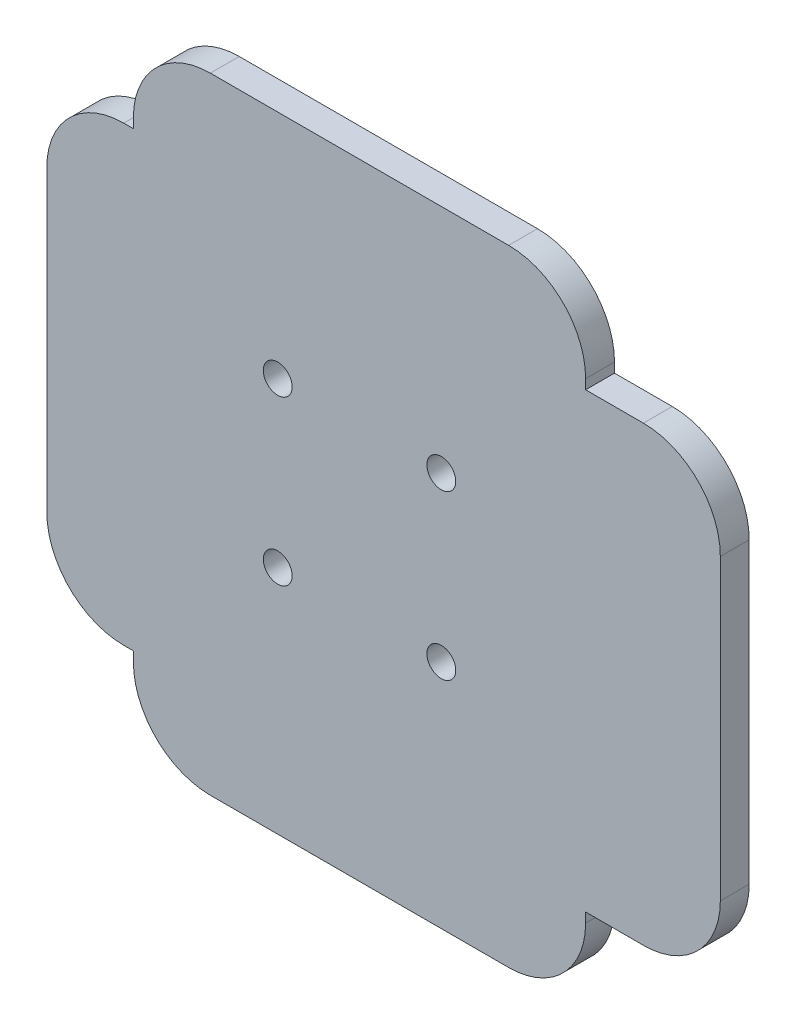
ISO-10303-21;
HEADER;
FILE_DESCRIPTION(('STEP AP214'),'2;1');
FILE_NAME('part.step','',(''),(''),'','','');
FILE_SCHEMA(('AUTOMOTIVE_DESIGN { 1 0 10303 214 1 1 1 1 }'));
ENDSEC;
DATA;
#1=APPLICATION_CONTEXT('core data for automotive mechanical design processes');
#2=APPLICATION_PROTOCOL_DEFINITION('international standard','automotive_design',2000,#1);
#3=PRODUCT_CONTEXT('',#1,'mechanical');
#4=PRODUCT('Part','Part','',(#3));
#5=PRODUCT_RELATED_PRODUCT_CATEGORY('part','',(#4));
#6=PRODUCT_DEFINITION_FORMATION('','',#4);
#7=PRODUCT_DEFINITION_CONTEXT('part definition',#1,'design');
#8=PRODUCT_DEFINITION('design','',#6,#7);
#9=PRODUCT_DEFINITION_SHAPE('','',#8);
#10=(LENGTH_UNIT() NAMED_UNIT(*) SI_UNIT(.MILLI.,.METRE.));
#11=(NAMED_UNIT(*) PLANE_ANGLE_UNIT() SI_UNIT($,.RADIAN.));
#12=(NAMED_UNIT(*) SI_UNIT($,.STERADIAN.) SOLID_ANGLE_UNIT());
#13=UNCERTAINTY_MEASURE_WITH_UNIT(LENGTH_MEASURE(1.E-05),#10,'distance_accuracy_value','');
#14=(GEOMETRIC_REPRESENTATION_CONTEXT(3) GLOBAL_UNCERTAINTY_ASSIGNED_CONTEXT((#13)) GLOBAL_UNIT_ASSIGNED_CONTEXT((#10,
#11,#12)) REPRESENTATION_CONTEXT('',''));
#15=CARTESIAN_POINT('',(0.,0.,0.));
#16=DIRECTION('',(0.,0.,1.));
#17=DIRECTION('',(1.,0.,0.));
#18=AXIS2_PLACEMENT_3D('',#15,#16,#17);
#19=CARTESIAN_POINT('',(7.50000000000001,-1.5,3.));
#20=DIRECTION('',(0.,0.,-1.));
#21=DIRECTION('',(-1.,0.,0.));
#22=AXIS2_PLACEMENT_3D('',#19,#20,#21);
#23=CYLINDRICAL_SURFACE('',#22,8.);
#24=CARTESIAN_POINT('',(7.50000000000001,-1.5,0.));
#25=DIRECTION('',(0.,0.,1.));
#26=DIRECTION('',(1.,0.,0.));
#27=AXIS2_PLACEMENT_3D('',#24,#25,#26);
#28=CIRCLE('',#27,8.);
#29=CARTESIAN_POINT('',(-0.5,-1.5,0.));
#30=VERTEX_POINT('',#29);
#31=CARTESIAN_POINT('',(7.50000000000001,-9.50000000000001,0.));
#32=VERTEX_POINT('',#31);
#33=EDGE_CURVE('E202',#30,#32,#28,.T.);
#34=ORIENTED_EDGE('',*,*,#33,.T.);
#35=DIRECTION('',(0.,0.,-1.));
#36=VECTOR('',#35,1.);
#37=CARTESIAN_POINT('',(7.50000000000001,-9.50000000000001,3.));
#38=LINE('',#37,#36);
#39=CARTESIAN_POINT('',(7.50000000000001,-9.50000000000001,3.));
#40=VERTEX_POINT('',#39);
#41=EDGE_CURVE('E11',#40,#32,#38,.T.);
#42=ORIENTED_EDGE('',*,*,#41,.F.);
#43=CARTESIAN_POINT('',(7.50000000000001,-1.5,3.));
#44=DIRECTION('',(0.,0.,1.));
#45=DIRECTION('',(1.,0.,0.));
#46=AXIS2_PLACEMENT_3D('',#43,#44,#45);
#47=CIRCLE('',#46,8.);
#48=CARTESIAN_POINT('',(-0.5,-1.5,3.));
#49=VERTEX_POINT('',#48);
#50=EDGE_CURVE('E241',#49,#40,#47,.T.);
#51=ORIENTED_EDGE('',*,*,#50,.F.);
#52=DIRECTION('',(0.,0.,-1.));
#53=VECTOR('',#52,1.);
#54=CARTESIAN_POINT('',(-0.5,-1.5,3.));
#55=LINE('',#54,#53);
#56=EDGE_CURVE('E198',#49,#30,#55,.T.);
#57=ORIENTED_EDGE('',*,*,#56,.T.);
#58=EDGE_LOOP('',(#34,#42,#51,#57));
#59=FACE_BOUND('',#58,.T.);
#60=ADVANCED_FACE('F34',(#59),#23,.T.);
#61=CARTESIAN_POINT('',(7.50000000000001,-9.50000000000001,3.));
#62=DIRECTION('',(0.,1.,0.));
#63=DIRECTION('',(0.,0.,1.));
#64=AXIS2_PLACEMENT_3D('',#61,#62,#63);
#65=PLANE('',#64);
#66=DIRECTION('',(1.,0.,0.));
#67=VECTOR('',#66,1.);
#68=CARTESIAN_POINT('',(7.50000000000001,-9.50000000000001,0.));
#69=LINE('',#68,#67);
#70=CARTESIAN_POINT('',(38.5,-9.50000000000001,0.));
#71=VERTEX_POINT('',#70);
#72=EDGE_CURVE('E205',#32,#71,#69,.T.);
#73=ORIENTED_EDGE('',*,*,#72,.T.);
#74=DIRECTION('',(0.,0.,-1.));
#75=VECTOR('',#74,1.);
#76=CARTESIAN_POINT('',(38.5,-9.50000000000001,3.));
#77=LINE('',#76,#75);
#78=CARTESIAN_POINT('',(38.5,-9.50000000000001,3.));
#79=VERTEX_POINT('',#78);
#80=EDGE_CURVE('E42',#79,#71,#77,.T.);
#81=ORIENTED_EDGE('',*,*,#80,.F.);
#82=DIRECTION('',(1.,0.,0.));
#83=VECTOR('',#82,1.);
#84=CARTESIAN_POINT('',(7.50000000000001,-9.50000000000001,3.));
#85=LINE('',#84,#83);
#86=EDGE_CURVE('E129',#40,#79,#85,.T.);
#87=ORIENTED_EDGE('',*,*,#86,.F.);
#88=ORIENTED_EDGE('',*,*,#41,.T.);
#89=EDGE_LOOP('',(#73,#81,#87,#88));
#90=FACE_BOUND('',#89,.T.);
#91=ADVANCED_FACE('F360',(#90),#65,.F.);
#92=CARTESIAN_POINT('',(38.5,-1.5,3.));
#93=DIRECTION('',(0.,0.,-1.));
#94=DIRECTION('',(-1.,0.,0.));
#95=AXIS2_PLACEMENT_3D('',#92,#93,#94);
#96=CYLINDRICAL_SURFACE('',#95,8.);
#97=CARTESIAN_POINT('',(38.5,-1.5,0.));
#98=DIRECTION('',(0.,0.,1.));
#99=DIRECTION('',(1.,0.,0.));
#100=AXIS2_PLACEMENT_3D('',#97,#98,#99);
#101=CIRCLE('',#100,8.);
#102=CARTESIAN_POINT('',(46.5,-1.5,0.));
#103=VERTEX_POINT('',#102);
#104=EDGE_CURVE('E208',#71,#103,#101,.T.);
#105=ORIENTED_EDGE('',*,*,#104,.T.);
#106=DIRECTION('',(0.,0.,-1.));
#107=VECTOR('',#106,1.);
#108=CARTESIAN_POINT('',(46.5,-1.5,3.));
#109=LINE('',#108,#107);
#110=CARTESIAN_POINT('',(46.5,-1.5,3.));
#111=VERTEX_POINT('',#110);
#112=EDGE_CURVE('E284',#111,#103,#109,.T.);
#113=ORIENTED_EDGE('',*,*,#112,.F.);
#114=CARTESIAN_POINT('',(38.5,-1.5,3.));
#115=DIRECTION('',(0.,0.,1.));
#116=DIRECTION('',(1.,0.,0.));
#117=AXIS2_PLACEMENT_3D('',#114,#115,#116);
#118=CIRCLE('',#117,8.);
#119=EDGE_CURVE('E292',#79,#111,#118,.T.);
#120=ORIENTED_EDGE('',*,*,#119,.F.);
#121=ORIENTED_EDGE('',*,*,#80,.T.);
#122=EDGE_LOOP('',(#105,#113,#120,#121));
#123=FACE_BOUND('',#122,.T.);
#124=ADVANCED_FACE('F290',(#123),#96,.T.);
#125=CARTESIAN_POINT('',(46.5,-1.5,3.));
#126=DIRECTION('',(-1.,0.,0.));
#127=DIRECTION('',(0.,0.,1.));
#128=AXIS2_PLACEMENT_3D('',#125,#126,#127);
#129=PLANE('',#128);
#130=DIRECTION('',(0.,1.,0.));
#131=VECTOR('',#130,1.);
#132=CARTESIAN_POINT('',(46.5,-1.5,0.));
#133=LINE('',#132,#131);
#134=CARTESIAN_POINT('',(46.5,-0.499999999999997,0.));
#135=VERTEX_POINT('',#134);
#136=EDGE_CURVE('E210',#103,#135,#133,.T.);
#137=ORIENTED_EDGE('',*,*,#136,.T.);
#138=DIRECTION('',(0.,0.,-1.));
#139=VECTOR('',#138,1.);
#140=CARTESIAN_POINT('',(46.5,-0.499999999999997,3.));
#141=LINE('',#140,#139);
#142=CARTESIAN_POINT('',(46.5,-0.499999999999997,3.));
#143=VERTEX_POINT('',#142);
#144=EDGE_CURVE('E281',#143,#135,#141,.T.);
#145=ORIENTED_EDGE('',*,*,#144,.F.);
#146=DIRECTION('',(0.,1.,0.));
#147=VECTOR('',#146,1.);
#148=CARTESIAN_POINT('',(46.5,-1.5,3.));
#149=LINE('',#148,#147);
#150=EDGE_CURVE('E310',#111,#143,#149,.T.);
#151=ORIENTED_EDGE('',*,*,#150,.F.);
#152=ORIENTED_EDGE('',*,*,#112,.T.);
#153=EDGE_LOOP('',(#137,#145,#151,#152));
#154=FACE_BOUND('',#153,.T.);
#155=ADVANCED_FACE('F301',(#154),#129,.F.);
#156=CARTESIAN_POINT('',(46.5,-0.499999999999997,3.));
#157=DIRECTION('',(0.,1.,0.));
#158=DIRECTION('',(-1.,0.,0.));
#159=AXIS2_PLACEMENT_3D('',#156,#157,#158);
#160=PLANE('',#159);
#161=DIRECTION('',(1.,0.,0.));
#162=VECTOR('',#161,1.);
#163=CARTESIAN_POINT('',(46.5,-0.499999999999997,0.));
#164=LINE('',#163,#162);
#165=CARTESIAN_POINT('',(52.5,-0.500000000000025,0.));
#166=VERTEX_POINT('',#165);
#167=EDGE_CURVE('E212',#135,#166,#164,.T.);
#168=ORIENTED_EDGE('',*,*,#167,.T.);
#169=DIRECTION('',(0.,0.,-1.));
#170=VECTOR('',#169,1.);
#171=CARTESIAN_POINT('',(52.5,-0.500000000000025,3.));
#172=LINE('',#171,#170);
#173=CARTESIAN_POINT('',(52.5,-0.500000000000025,3.));
#174=VERTEX_POINT('',#173);
#175=EDGE_CURVE('E278',#174,#166,#172,.T.);
#176=ORIENTED_EDGE('',*,*,#175,.F.);
#177=DIRECTION('',(1.,0.,0.));
#178=VECTOR('',#177,1.);
#179=CARTESIAN_POINT('',(46.5,-0.499999999999997,3.));
#180=LINE('',#179,#178);
#181=EDGE_CURVE('E307',#143,#174,#180,.T.);
#182=ORIENTED_EDGE('',*,*,#181,.F.);
#183=ORIENTED_EDGE('',*,*,#144,.T.);
#184=EDGE_LOOP('',(#168,#176,#182,#183));
#185=FACE_BOUND('',#184,.T.);
#186=ADVANCED_FACE('F305',(#185),#160,.F.);
#187=CARTESIAN_POINT('',(52.5,7.49999999999995,3.));
#188=DIRECTION('',(0.,0.,-1.));
#189=DIRECTION('',(-1.,0.,0.));
#190=AXIS2_PLACEMENT_3D('',#187,#188,#189);
#191=CYLINDRICAL_SURFACE('',#190,7.99999999999998);
#192=CARTESIAN_POINT('',(52.5,7.49999999999995,0.));
#193=DIRECTION('',(0.,0.,1.));
#194=DIRECTION('',(1.,0.,0.));
#195=AXIS2_PLACEMENT_3D('',#192,#193,#194);
#196=CIRCLE('',#195,7.99999999999998);
#197=CARTESIAN_POINT('',(60.5,7.49999999999995,0.));
#198=VERTEX_POINT('',#197);
#199=EDGE_CURVE('E214',#166,#198,#196,.T.);
#200=ORIENTED_EDGE('',*,*,#199,.T.);
#201=DIRECTION('',(0.,0.,-1.));
#202=VECTOR('',#201,1.);
#203=CARTESIAN_POINT('',(60.5,7.49999999999995,3.));
#204=LINE('',#203,#202);
#205=CARTESIAN_POINT('',(60.5,7.49999999999995,3.));
#206=VERTEX_POINT('',#205);
#207=EDGE_CURVE('E275',#206,#198,#204,.T.);
#208=ORIENTED_EDGE('',*,*,#207,.F.);
#209=CARTESIAN_POINT('',(52.5,7.49999999999995,3.));
#210=DIRECTION('',(0.,0.,1.));
#211=DIRECTION('',(1.,0.,0.));
#212=AXIS2_PLACEMENT_3D('',#209,#210,#211);
#213=CIRCLE('',#212,7.99999999999998);
#214=EDGE_CURVE('E309',#174,#206,#213,.T.);
#215=ORIENTED_EDGE('',*,*,#214,.F.);
#216=ORIENTED_EDGE('',*,*,#175,.T.);
#217=EDGE_LOOP('',(#200,#208,#215,#216));
#218=FACE_BOUND('',#217,.T.);
#219=ADVANCED_FACE('F373',(#218),#191,.T.);
#220=CARTESIAN_POINT('',(60.5,7.49999999999995,3.));
#221=DIRECTION('',(-1.,0.,0.));
#222=DIRECTION('',(0.,-1.,0.));
#223=AXIS2_PLACEMENT_3D('',#220,#221,#222);
#224=PLANE('',#223);
#225=DIRECTION('',(0.,1.,0.));
#226=VECTOR('',#225,1.);
#227=CARTESIAN_POINT('',(60.5,7.49999999999995,0.));
#228=LINE('',#227,#226);
#229=CARTESIAN_POINT('',(60.5,38.5000000000001,0.));
#230=VERTEX_POINT('',#229);
#231=EDGE_CURVE('E216',#198,#230,#228,.T.);
#232=ORIENTED_EDGE('',*,*,#231,.T.);
#233=DIRECTION('',(0.,0.,-1.));
#234=VECTOR('',#233,1.);
#235=CARTESIAN_POINT('',(60.5,38.5000000000001,3.));
#236=LINE('',#235,#234);
#237=CARTESIAN_POINT('',(60.5,38.5000000000001,3.));
#238=VERTEX_POINT('',#237);
#239=EDGE_CURVE('E272',#238,#230,#236,.T.);
#240=ORIENTED_EDGE('',*,*,#239,.F.);
#241=DIRECTION('',(0.,1.,0.));
#242=VECTOR('',#241,1.);
#243=CARTESIAN_POINT('',(60.5,7.49999999999995,3.));
#244=LINE('',#243,#242);
#245=EDGE_CURVE('E312',#206,#238,#244,.T.);
#246=ORIENTED_EDGE('',*,*,#245,.F.);
#247=ORIENTED_EDGE('',*,*,#207,.T.);
#248=EDGE_LOOP('',(#232,#240,#246,#247));
#249=FACE_BOUND('',#248,.T.);
#250=ADVANCED_FACE('F376',(#249),#224,.F.);
#251=CARTESIAN_POINT('',(52.5,38.5000000000001,3.));
#252=DIRECTION('',(0.,0.,-1.));
#253=DIRECTION('',(-1.,0.,0.));
#254=AXIS2_PLACEMENT_3D('',#251,#252,#253);
#255=CYLINDRICAL_SURFACE('',#254,8.00000000000001);
#256=CARTESIAN_POINT('',(52.5,38.5000000000001,0.));
#257=DIRECTION('',(0.,0.,1.));
#258=DIRECTION('',(1.,0.,0.));
#259=AXIS2_PLACEMENT_3D('',#256,#257,#258);
#260=CIRCLE('',#259,8.00000000000001);
#261=CARTESIAN_POINT('',(52.5,46.5000000000001,0.));
#262=VERTEX_POINT('',#261);
#263=EDGE_CURVE('E218',#230,#262,#260,.T.);
#264=ORIENTED_EDGE('',*,*,#263,.T.);
#265=DIRECTION('',(0.,0.,-1.));
#266=VECTOR('',#265,1.);
#267=CARTESIAN_POINT('',(52.5,46.5000000000001,3.));
#268=LINE('',#267,#266);
#269=CARTESIAN_POINT('',(52.5,46.5000000000001,3.));
#270=VERTEX_POINT('',#269);
#271=EDGE_CURVE('E269',#270,#262,#268,.T.);
#272=ORIENTED_EDGE('',*,*,#271,.F.);
#273=CARTESIAN_POINT('',(52.5,38.5000000000001,3.));
#274=DIRECTION('',(0.,0.,1.));
#275=DIRECTION('',(1.,0.,0.));
#276=AXIS2_PLACEMENT_3D('',#273,#274,#275);
#277=CIRCLE('',#276,8.00000000000001);
#278=EDGE_CURVE('E318',#238,#270,#277,.T.);
#279=ORIENTED_EDGE('',*,*,#278,.F.);
#280=ORIENTED_EDGE('',*,*,#239,.T.);
#281=EDGE_LOOP('',(#264,#272,#279,#280));
#282=FACE_BOUND('',#281,.T.);
#283=ADVANCED_FACE('F380',(#282),#255,.T.);
#284=CARTESIAN_POINT('',(52.5,46.5000000000001,3.));
#285=DIRECTION('',(0.,-1.,0.));
#286=DIRECTION('',(1.,0.,0.));
#287=AXIS2_PLACEMENT_3D('',#284,#285,#286);
#288=PLANE('',#287);
#289=DIRECTION('',(-1.,0.,0.));
#290=VECTOR('',#289,1.);
#291=CARTESIAN_POINT('',(52.5,46.5000000000001,0.));
#292=LINE('',#291,#290);
#293=CARTESIAN_POINT('',(46.5,46.5000000000001,0.));
#294=VERTEX_POINT('',#293);
#295=EDGE_CURVE('E220',#262,#294,#292,.T.);
#296=ORIENTED_EDGE('',*,*,#295,.T.);
#297=DIRECTION('',(0.,0.,-1.));
#298=VECTOR('',#297,1.);
#299=CARTESIAN_POINT('',(46.5,46.5000000000001,3.));
#300=LINE('',#299,#298);
#301=CARTESIAN_POINT('',(46.5,46.5000000000001,3.));
#302=VERTEX_POINT('',#301);
#303=EDGE_CURVE('E266',#302,#294,#300,.T.);
#304=ORIENTED_EDGE('',*,*,#303,.F.);
#305=DIRECTION('',(-1.,0.,0.));
#306=VECTOR('',#305,1.);
#307=CARTESIAN_POINT('',(52.5,46.5000000000001,3.));
#308=LINE('',#307,#306);
#309=EDGE_CURVE('E320',#270,#302,#308,.T.);
#310=ORIENTED_EDGE('',*,*,#309,.F.);
#311=ORIENTED_EDGE('',*,*,#271,.T.);
#312=EDGE_LOOP('',(#296,#304,#310,#311));
#313=FACE_BOUND('',#312,.T.);
#314=ADVANCED_FACE('F384',(#313),#288,.F.);
#315=CARTESIAN_POINT('',(46.5,46.5000000000001,3.));
#316=DIRECTION('',(-1.,0.,0.));
#317=DIRECTION('',(0.,0.,1.));
#318=AXIS2_PLACEMENT_3D('',#315,#316,#317);
#319=PLANE('',#318);
#320=DIRECTION('',(0.,1.,0.));
#321=VECTOR('',#320,1.);
#322=CARTESIAN_POINT('',(46.5,46.5000000000001,0.));
#323=LINE('',#322,#321);
#324=CARTESIAN_POINT('',(46.5,47.5,0.));
#325=VERTEX_POINT('',#324);
#326=EDGE_CURVE('E222',#294,#325,#323,.T.);
#327=ORIENTED_EDGE('',*,*,#326,.T.);
#328=DIRECTION('',(0.,0.,-1.));
#329=VECTOR('',#328,1.);
#330=CARTESIAN_POINT('',(46.5,47.5,3.));
#331=LINE('',#330,#329);
#332=CARTESIAN_POINT('',(46.5,47.5,3.));
#333=VERTEX_POINT('',#332);
#334=EDGE_CURVE('E263',#333,#325,#331,.T.);
#335=ORIENTED_EDGE('',*,*,#334,.F.);
#336=DIRECTION('',(0.,1.,0.));
#337=VECTOR('',#336,1.);
#338=CARTESIAN_POINT('',(46.5,46.5000000000001,3.));
#339=LINE('',#338,#337);
#340=EDGE_CURVE('E322',#302,#333,#339,.T.);
#341=ORIENTED_EDGE('',*,*,#340,.F.);
#342=ORIENTED_EDGE('',*,*,#303,.T.);
#343=EDGE_LOOP('',(#327,#335,#341,#342));
#344=FACE_BOUND('',#343,.T.);
#345=ADVANCED_FACE('F388',(#344),#319,.F.);
#346=CARTESIAN_POINT('',(38.5,47.5,3.));
#347=DIRECTION('',(0.,0.,-1.));
#348=DIRECTION('',(-1.,0.,0.));
#349=AXIS2_PLACEMENT_3D('',#346,#347,#348);
#350=CYLINDRICAL_SURFACE('',#349,8.);
#351=CARTESIAN_POINT('',(38.5,47.5,0.));
#352=DIRECTION('',(0.,0.,1.));
#353=DIRECTION('',(1.,0.,0.));
#354=AXIS2_PLACEMENT_3D('',#351,#352,#353);
#355=CIRCLE('',#354,8.);
#356=CARTESIAN_POINT('',(38.5,55.5,0.));
#357=VERTEX_POINT('',#356);
#358=EDGE_CURVE('E224',#325,#357,#355,.T.);
#359=ORIENTED_EDGE('',*,*,#358,.T.);
#360=DIRECTION('',(0.,0.,-1.));
#361=VECTOR('',#360,1.);
#362=CARTESIAN_POINT('',(38.5,55.5,3.));
#363=LINE('',#362,#361);
#364=CARTESIAN_POINT('',(38.5,55.5,3.));
#365=VERTEX_POINT('',#364);
#366=EDGE_CURVE('E260',#365,#357,#363,.T.);
#367=ORIENTED_EDGE('',*,*,#366,.F.);
#368=CARTESIAN_POINT('',(38.5,47.5,3.));
#369=DIRECTION('',(0.,0.,1.));
#370=DIRECTION('',(1.,0.,0.));
#371=AXIS2_PLACEMENT_3D('',#368,#369,#370);
#372=CIRCLE('',#371,8.);
#373=EDGE_CURVE('E324',#333,#365,#372,.T.);
#374=ORIENTED_EDGE('',*,*,#373,.F.);
#375=ORIENTED_EDGE('',*,*,#334,.T.);
#376=EDGE_LOOP('',(#359,#367,#374,#375));
#377=FACE_BOUND('',#376,.T.);
#378=ADVANCED_FACE('F392',(#377),#350,.T.);
#379=CARTESIAN_POINT('',(38.5,55.5,3.));
#380=DIRECTION('',(0.,-1.,0.));
#381=DIRECTION('',(0.,0.,-1.));
#382=AXIS2_PLACEMENT_3D('',#379,#380,#381);
#383=PLANE('',#382);
#384=DIRECTION('',(-1.,0.,0.));
#385=VECTOR('',#384,1.);
#386=CARTESIAN_POINT('',(38.5,55.5,0.));
#387=LINE('',#386,#385);
#388=CARTESIAN_POINT('',(7.50000000000001,55.5,0.));
#389=VERTEX_POINT('',#388);
#390=EDGE_CURVE('E226',#357,#389,#387,.T.);
#391=ORIENTED_EDGE('',*,*,#390,.T.);
#392=DIRECTION('',(0.,0.,-1.));
#393=VECTOR('',#392,1.);
#394=CARTESIAN_POINT('',(7.50000000000001,55.5,3.));
#395=LINE('',#394,#393);
#396=CARTESIAN_POINT('',(7.50000000000001,55.5,3.));
#397=VERTEX_POINT('',#396);
#398=EDGE_CURVE('E257',#397,#389,#395,.T.);
#399=ORIENTED_EDGE('',*,*,#398,.F.);
#400=DIRECTION('',(-1.,0.,0.));
#401=VECTOR('',#400,1.);
#402=CARTESIAN_POINT('',(38.5,55.5,3.));
#403=LINE('',#402,#401);
#404=EDGE_CURVE('E326',#365,#397,#403,.T.);
#405=ORIENTED_EDGE('',*,*,#404,.F.);
#406=ORIENTED_EDGE('',*,*,#366,.T.);
#407=EDGE_LOOP('',(#391,#399,#405,#406));
#408=FACE_BOUND('',#407,.T.);
#409=ADVANCED_FACE('F396',(#408),#383,.F.);
#410=CARTESIAN_POINT('',(7.50000000000001,47.5,3.));
#411=DIRECTION('',(0.,0.,-1.));
#412=DIRECTION('',(-1.,0.,0.));
#413=AXIS2_PLACEMENT_3D('',#410,#411,#412);
#414=CYLINDRICAL_SURFACE('',#413,8.);
#415=CARTESIAN_POINT('',(7.50000000000001,47.5,0.));
#416=DIRECTION('',(0.,0.,1.));
#417=DIRECTION('',(1.,0.,0.));
#418=AXIS2_PLACEMENT_3D('',#415,#416,#417);
#419=CIRCLE('',#418,8.);
#420=CARTESIAN_POINT('',(-0.5,47.5,0.));
#421=VERTEX_POINT('',#420);
#422=EDGE_CURVE('E228',#389,#421,#419,.T.);
#423=ORIENTED_EDGE('',*,*,#422,.T.);
#424=DIRECTION('',(0.,0.,-1.));
#425=VECTOR('',#424,1.);
#426=CARTESIAN_POINT('',(-0.5,47.5,3.));
#427=LINE('',#426,#425);
#428=CARTESIAN_POINT('',(-0.5,47.5,3.));
#429=VERTEX_POINT('',#428);
#430=EDGE_CURVE('E254',#429,#421,#427,.T.);
#431=ORIENTED_EDGE('',*,*,#430,.F.);
#432=CARTESIAN_POINT('',(7.50000000000001,47.5,3.));
#433=DIRECTION('',(0.,0.,1.));
#434=DIRECTION('',(1.,0.,0.));
#435=AXIS2_PLACEMENT_3D('',#432,#433,#434);
#436=CIRCLE('',#435,8.);
#437=EDGE_CURVE('E328',#397,#429,#436,.T.);
#438=ORIENTED_EDGE('',*,*,#437,.F.);
#439=ORIENTED_EDGE('',*,*,#398,.T.);
#440=EDGE_LOOP('',(#423,#431,#438,#439));
#441=FACE_BOUND('',#440,.T.);
#442=ADVANCED_FACE('F400',(#441),#414,.T.);
#443=CARTESIAN_POINT('',(-0.5,47.5,3.));
#444=DIRECTION('',(1.,0.,0.));
#445=DIRECTION('',(0.,0.,-1.));
#446=AXIS2_PLACEMENT_3D('',#443,#444,#445);
#447=PLANE('',#446);
#448=DIRECTION('',(0.,-1.,0.));
#449=VECTOR('',#448,1.);
#450=CARTESIAN_POINT('',(-0.5,47.5,0.));
#451=LINE('',#450,#449);
#452=CARTESIAN_POINT('',(-0.5,46.5,0.));
#453=VERTEX_POINT('',#452);
#454=EDGE_CURVE('E230',#421,#453,#451,.T.);
#455=ORIENTED_EDGE('',*,*,#454,.T.);
#456=DIRECTION('',(0.,0.,-1.));
#457=VECTOR('',#456,1.);
#458=CARTESIAN_POINT('',(-0.5,46.5,3.));
#459=LINE('',#458,#457);
#460=CARTESIAN_POINT('',(-0.5,46.5,3.));
#461=VERTEX_POINT('',#460);
#462=EDGE_CURVE('E251',#461,#453,#459,.T.);
#463=ORIENTED_EDGE('',*,*,#462,.F.);
#464=DIRECTION('',(0.,-1.,0.));
#465=VECTOR('',#464,1.);
#466=CARTESIAN_POINT('',(-0.5,47.5,3.));
#467=LINE('',#466,#465);
#468=EDGE_CURVE('E330',#429,#461,#467,.T.);
#469=ORIENTED_EDGE('',*,*,#468,.F.);
#470=ORIENTED_EDGE('',*,*,#430,.T.);
#471=EDGE_LOOP('',(#455,#463,#469,#470));
#472=FACE_BOUND('',#471,.T.);
#473=ADVANCED_FACE('F404',(#472),#447,.F.);
#474=CARTESIAN_POINT('',(-0.5,46.5,3.));
#475=DIRECTION('',(0.,-1.,0.));
#476=DIRECTION('',(0.,0.,-1.));
#477=AXIS2_PLACEMENT_3D('',#474,#475,#476);
#478=PLANE('',#477);
#479=DIRECTION('',(-1.,0.,0.));
#480=VECTOR('',#479,1.);
#481=CARTESIAN_POINT('',(-0.5,46.5,0.));
#482=LINE('',#481,#480);
#483=CARTESIAN_POINT('',(-1.49999999999999,46.5,0.));
#484=VERTEX_POINT('',#483);
#485=EDGE_CURVE('E232',#453,#484,#482,.T.);
#486=ORIENTED_EDGE('',*,*,#485,.T.);
#487=DIRECTION('',(0.,0.,-1.));
#488=VECTOR('',#487,1.);
#489=CARTESIAN_POINT('',(-1.49999999999999,46.5,3.));
#490=LINE('',#489,#488);
#491=CARTESIAN_POINT('',(-1.49999999999999,46.5,3.));
#492=VERTEX_POINT('',#491);
#493=EDGE_CURVE('E248',#492,#484,#490,.T.);
#494=ORIENTED_EDGE('',*,*,#493,.F.);
#495=DIRECTION('',(-1.,0.,0.));
#496=VECTOR('',#495,1.);
#497=CARTESIAN_POINT('',(-0.5,46.5,3.));
#498=LINE('',#497,#496);
#499=EDGE_CURVE('E332',#461,#492,#498,.T.);
#500=ORIENTED_EDGE('',*,*,#499,.F.);
#501=ORIENTED_EDGE('',*,*,#462,.T.);
#502=EDGE_LOOP('',(#486,#494,#500,#501));
#503=FACE_BOUND('',#502,.T.);
#504=ADVANCED_FACE('F408',(#503),#478,.F.);
#505=CARTESIAN_POINT('',(-1.49999999999999,38.5,3.));
#506=DIRECTION('',(0.,0.,-1.));
#507=DIRECTION('',(-1.,0.,0.));
#508=AXIS2_PLACEMENT_3D('',#505,#506,#507);
#509=CYLINDRICAL_SURFACE('',#508,8.);
#510=CARTESIAN_POINT('',(-1.49999999999999,38.5,0.));
#511=DIRECTION('',(0.,0.,1.));
#512=DIRECTION('',(1.,0.,0.));
#513=AXIS2_PLACEMENT_3D('',#510,#511,#512);
#514=CIRCLE('',#513,8.);
#515=CARTESIAN_POINT('',(-9.49999999999998,38.4999999999999,0.));
#516=VERTEX_POINT('',#515);
#517=EDGE_CURVE('E234',#484,#516,#514,.T.);
#518=ORIENTED_EDGE('',*,*,#517,.T.);
#519=DIRECTION('',(0.,0.,-1.));
#520=VECTOR('',#519,1.);
#521=CARTESIAN_POINT('',(-9.49999999999998,38.4999999999999,3.));
#522=LINE('',#521,#520);
#523=CARTESIAN_POINT('',(-9.49999999999998,38.4999999999999,3.));
#524=VERTEX_POINT('',#523);
#525=EDGE_CURVE('E245',#524,#516,#522,.T.);
#526=ORIENTED_EDGE('',*,*,#525,.F.);
#527=CARTESIAN_POINT('',(-1.49999999999999,38.5,3.));
#528=DIRECTION('',(0.,0.,1.));
#529=DIRECTION('',(1.,0.,0.));
#530=AXIS2_PLACEMENT_3D('',#527,#528,#529);
#531=CIRCLE('',#530,8.);
#532=EDGE_CURVE('E334',#492,#524,#531,.T.);
#533=ORIENTED_EDGE('',*,*,#532,.F.);
#534=ORIENTED_EDGE('',*,*,#493,.T.);
#535=EDGE_LOOP('',(#518,#526,#533,#534));
#536=FACE_BOUND('',#535,.T.);
#537=ADVANCED_FACE('F340',(#536),#509,.T.);
#538=CARTESIAN_POINT('',(-9.49999999999998,38.4999999999999,3.));
#539=DIRECTION('',(1.,0.,0.));
#540=DIRECTION('',(0.,1.,0.));
#541=AXIS2_PLACEMENT_3D('',#538,#539,#540);
#542=PLANE('',#541);
#543=DIRECTION('',(0.,-1.,0.));
#544=VECTOR('',#543,1.);
#545=CARTESIAN_POINT('',(-9.49999999999998,38.4999999999999,0.));
#546=LINE('',#545,#544);
#547=CARTESIAN_POINT('',(-9.49999999999998,7.50000000000001,0.));
#548=VERTEX_POINT('',#547);
#549=EDGE_CURVE('E236',#516,#548,#546,.T.);
#550=ORIENTED_EDGE('',*,*,#549,.T.);
#551=DIRECTION('',(0.,0.,-1.));
#552=VECTOR('',#551,1.);
#553=CARTESIAN_POINT('',(-9.49999999999998,7.50000000000001,3.));
#554=LINE('',#553,#552);
#555=CARTESIAN_POINT('',(-9.49999999999998,7.50000000000001,3.));
#556=VERTEX_POINT('',#555);
#557=EDGE_CURVE('E193',#556,#548,#554,.T.);
#558=ORIENTED_EDGE('',*,*,#557,.F.);
#559=DIRECTION('',(0.,-1.,0.));
#560=VECTOR('',#559,1.);
#561=CARTESIAN_POINT('',(-9.49999999999998,38.4999999999999,3.));
#562=LINE('',#561,#560);
#563=EDGE_CURVE('E184',#524,#556,#562,.T.);
#564=ORIENTED_EDGE('',*,*,#563,.F.);
#565=ORIENTED_EDGE('',*,*,#525,.T.);
#566=EDGE_LOOP('',(#550,#558,#564,#565));
#567=FACE_BOUND('',#566,.T.);
#568=ADVANCED_FACE('F344',(#567),#542,.F.);
#569=CARTESIAN_POINT('',(-1.49999999999999,7.5,3.));
#570=DIRECTION('',(0.,0.,-1.));
#571=DIRECTION('',(-1.,0.,0.));
#572=AXIS2_PLACEMENT_3D('',#569,#570,#571);
#573=CYLINDRICAL_SURFACE('',#572,8.);
#574=CARTESIAN_POINT('',(-1.49999999999999,7.5,0.));
#575=DIRECTION('',(0.,0.,1.));
#576=DIRECTION('',(1.,0.,0.));
#577=AXIS2_PLACEMENT_3D('',#574,#575,#576);
#578=CIRCLE('',#577,8.);
#579=CARTESIAN_POINT('',(-1.49999999999999,-0.499999999999997,0.));
#580=VERTEX_POINT('',#579);
#581=EDGE_CURVE('E192',#548,#580,#578,.T.);
#582=ORIENTED_EDGE('',*,*,#581,.T.);
#583=DIRECTION('',(0.,0.,-1.));
#584=VECTOR('',#583,1.);
#585=CARTESIAN_POINT('',(-1.49999999999999,-0.499999999999997,3.));
#586=LINE('',#585,#584);
#587=CARTESIAN_POINT('',(-1.49999999999999,-0.499999999999997,3.));
#588=VERTEX_POINT('',#587);
#589=EDGE_CURVE('E189',#588,#580,#586,.T.);
#590=ORIENTED_EDGE('',*,*,#589,.F.);
#591=CARTESIAN_POINT('',(-1.49999999999999,7.5,3.));
#592=DIRECTION('',(0.,0.,1.));
#593=DIRECTION('',(1.,0.,0.));
#594=AXIS2_PLACEMENT_3D('',#591,#592,#593);
#595=CIRCLE('',#594,8.);
#596=EDGE_CURVE('E178',#556,#588,#595,.T.);
#597=ORIENTED_EDGE('',*,*,#596,.F.);
#598=ORIENTED_EDGE('',*,*,#557,.T.);
#599=EDGE_LOOP('',(#582,#590,#597,#598));
#600=FACE_BOUND('',#599,.T.);
#601=ADVANCED_FACE('F190',(#600),#573,.T.);
#602=CARTESIAN_POINT('',(-1.49999999999999,-0.499999999999997,3.));
#603=DIRECTION('',(0.,1.,0.));
#604=DIRECTION('',(0.,0.,1.));
#605=AXIS2_PLACEMENT_3D('',#602,#603,#604);
#606=PLANE('',#605);
#607=DIRECTION('',(1.,0.,0.));
#608=VECTOR('',#607,1.);
#609=CARTESIAN_POINT('',(-1.49999999999999,-0.499999999999997,0.));
#610=LINE('',#609,#608);
#611=CARTESIAN_POINT('',(-0.5,-0.499999999999997,0.));
#612=VERTEX_POINT('',#611);
#613=EDGE_CURVE('E115',#580,#612,#610,.T.);
#614=ORIENTED_EDGE('',*,*,#613,.T.);
#615=DIRECTION('',(0.,0.,-1.));
#616=VECTOR('',#615,1.);
#617=CARTESIAN_POINT('',(-0.5,-0.499999999999997,3.));
#618=LINE('',#617,#616);
#619=CARTESIAN_POINT('',(-0.5,-0.499999999999997,3.));
#620=VERTEX_POINT('',#619);
#621=EDGE_CURVE('E194',#620,#612,#618,.T.);
#622=ORIENTED_EDGE('',*,*,#621,.F.);
#623=DIRECTION('',(1.,0.,0.));
#624=VECTOR('',#623,1.);
#625=CARTESIAN_POINT('',(-1.49999999999999,-0.499999999999997,3.));
#626=LINE('',#625,#624);
#627=EDGE_CURVE('E182',#588,#620,#626,.T.);
#628=ORIENTED_EDGE('',*,*,#627,.F.);
#629=ORIENTED_EDGE('',*,*,#589,.T.);
#630=EDGE_LOOP('',(#614,#622,#628,#629));
#631=FACE_BOUND('',#630,.T.);
#632=ADVANCED_FACE('F196',(#631),#606,.F.);
#633=CARTESIAN_POINT('',(-0.5,-0.499999999999997,3.));
#634=DIRECTION('',(1.,0.,0.));
#635=DIRECTION('',(0.,1.,0.));
#636=AXIS2_PLACEMENT_3D('',#633,#634,#635);
#637=PLANE('',#636);
#638=DIRECTION('',(0.,-1.,0.));
#639=VECTOR('',#638,1.);
#640=CARTESIAN_POINT('',(-0.5,-0.499999999999997,0.));
#641=LINE('',#640,#639);
#642=EDGE_CURVE('E121',#612,#30,#641,.T.);
#643=ORIENTED_EDGE('',*,*,#642,.T.);
#644=ORIENTED_EDGE('',*,*,#56,.F.);
#645=DIRECTION('',(0.,-1.,0.));
#646=VECTOR('',#645,1.);
#647=CARTESIAN_POINT('',(-0.5,-0.499999999999997,3.));
#648=LINE('',#647,#646);
#649=EDGE_CURVE('E50',#620,#49,#648,.T.);
#650=ORIENTED_EDGE('',*,*,#649,.F.);
#651=ORIENTED_EDGE('',*,*,#621,.T.);
#652=EDGE_LOOP('',(#643,#644,#650,#651));
#653=FACE_BOUND('',#652,.T.);
#654=ADVANCED_FACE('F348',(#653),#637,.F.);
#655=CARTESIAN_POINT('',(7.50000000000001,-1.5,3.));
#656=DIRECTION('',(0.,0.,1.));
#657=DIRECTION('',(1.,0.,0.));
#658=AXIS2_PLACEMENT_3D('',#655,#656,#657);
#659=PLANE('',#658);
#660=CARTESIAN_POINT('',(31.5,14.5,3.));
#661=DIRECTION('',(0.,0.,1.));
#662=DIRECTION('',(1.,0.,0.));
#663=AXIS2_PLACEMENT_3D('',#660,#661,#662);
#664=CIRCLE('',#663,1.5);
#665=CARTESIAN_POINT('',(33.,14.5,3.));
#666=VERTEX_POINT('',#665);
#667=EDGE_CURVE('E478',#666,#666,#664,.T.);
#668=ORIENTED_EDGE('',*,*,#667,.F.);
#669=EDGE_LOOP('',(#668));
#670=FACE_BOUND('',#669,.T.);
#671=CARTESIAN_POINT('',(14.5,14.5,3.));
#672=DIRECTION('',(0.,0.,1.));
#673=DIRECTION('',(1.,0.,0.));
#674=AXIS2_PLACEMENT_3D('',#671,#672,#673);
#675=CIRCLE('',#674,1.5);
#676=CARTESIAN_POINT('',(16.,14.5,3.));
#677=VERTEX_POINT('',#676);
#678=EDGE_CURVE('E480',#677,#677,#675,.T.);
#679=ORIENTED_EDGE('',*,*,#678,.F.);
#680=EDGE_LOOP('',(#679));
#681=FACE_BOUND('',#680,.T.);
#682=CARTESIAN_POINT('',(14.5,31.5,3.));
#683=DIRECTION('',(0.,0.,1.));
#684=DIRECTION('',(1.,0.,0.));
#685=AXIS2_PLACEMENT_3D('',#682,#683,#684);
#686=CIRCLE('',#685,1.5);
#687=CARTESIAN_POINT('',(16.,31.5,3.));
#688=VERTEX_POINT('',#687);
#689=EDGE_CURVE('E494',#688,#688,#686,.T.);
#690=ORIENTED_EDGE('',*,*,#689,.F.);
#691=EDGE_LOOP('',(#690));
#692=FACE_BOUND('',#691,.T.);
#693=CARTESIAN_POINT('',(31.5,31.5,3.));
#694=DIRECTION('',(0.,0.,1.));
#695=DIRECTION('',(1.,0.,0.));
#696=AXIS2_PLACEMENT_3D('',#693,#694,#695);
#697=CIRCLE('',#696,1.5);
#698=CARTESIAN_POINT('',(33.,31.5,3.));
#699=VERTEX_POINT('',#698);
#700=EDGE_CURVE('E486',#699,#699,#697,.T.);
#701=ORIENTED_EDGE('',*,*,#700,.F.);
#702=EDGE_LOOP('',(#701));
#703=FACE_BOUND('',#702,.T.);
#704=ORIENTED_EDGE('',*,*,#50,.T.);
#705=ORIENTED_EDGE('',*,*,#86,.T.);
#706=ORIENTED_EDGE('',*,*,#119,.T.);
#707=ORIENTED_EDGE('',*,*,#150,.T.);
#708=ORIENTED_EDGE('',*,*,#181,.T.);
#709=ORIENTED_EDGE('',*,*,#214,.T.);
#710=ORIENTED_EDGE('',*,*,#245,.T.);
#711=ORIENTED_EDGE('',*,*,#278,.T.);
#712=ORIENTED_EDGE('',*,*,#309,.T.);
#713=ORIENTED_EDGE('',*,*,#340,.T.);
#714=ORIENTED_EDGE('',*,*,#373,.T.);
#715=ORIENTED_EDGE('',*,*,#404,.T.);
#716=ORIENTED_EDGE('',*,*,#437,.T.);
#717=ORIENTED_EDGE('',*,*,#468,.T.);
#718=ORIENTED_EDGE('',*,*,#499,.T.);
#719=ORIENTED_EDGE('',*,*,#532,.T.);
#720=ORIENTED_EDGE('',*,*,#563,.T.);
#721=ORIENTED_EDGE('',*,*,#596,.T.);
#722=ORIENTED_EDGE('',*,*,#627,.T.);
#723=ORIENTED_EDGE('',*,*,#649,.T.);
#724=EDGE_LOOP('',(#704,#705,#706,#707,#708,#709,#710,#711,#712,#713,#714,#715,#716,#717,#718,
#719,#720,#721,#722,#723));
#725=FACE_BOUND('',#724,.T.);
#726=ADVANCED_FACE('F180',(#670,#681,#692,#703,#725),#659,.T.);
#727=CARTESIAN_POINT('',(7.50000000000001,-1.5,0.));
#728=DIRECTION('',(0.,0.,1.));
#729=DIRECTION('',(1.,0.,0.));
#730=AXIS2_PLACEMENT_3D('',#727,#728,#729);
#731=PLANE('',#730);
#732=CARTESIAN_POINT('',(31.5,14.5,0.));
#733=DIRECTION('',(0.,0.,1.));
#734=DIRECTION('',(1.,0.,0.));
#735=AXIS2_PLACEMENT_3D('',#732,#733,#734);
#736=CIRCLE('',#735,1.5);
#737=CARTESIAN_POINT('',(33.,14.5,0.));
#738=VERTEX_POINT('',#737);
#739=EDGE_CURVE('E475',#738,#738,#736,.T.);
#740=ORIENTED_EDGE('',*,*,#739,.T.);
#741=EDGE_LOOP('',(#740));
#742=FACE_BOUND('',#741,.T.);
#743=CARTESIAN_POINT('',(14.5,14.5,0.));
#744=DIRECTION('',(0.,0.,1.));
#745=DIRECTION('',(1.,0.,0.));
#746=AXIS2_PLACEMENT_3D('',#743,#744,#745);
#747=CIRCLE('',#746,1.5);
#748=CARTESIAN_POINT('',(16.,14.5,0.));
#749=VERTEX_POINT('',#748);
#750=EDGE_CURVE('E499',#749,#749,#747,.T.);
#751=ORIENTED_EDGE('',*,*,#750,.T.);
#752=EDGE_LOOP('',(#751));
#753=FACE_BOUND('',#752,.T.);
#754=CARTESIAN_POINT('',(14.5,31.5,0.));
#755=DIRECTION('',(0.,0.,1.));
#756=DIRECTION('',(1.,0.,0.));
#757=AXIS2_PLACEMENT_3D('',#754,#755,#756);
#758=CIRCLE('',#757,1.5);
#759=CARTESIAN_POINT('',(16.,31.5,0.));
#760=VERTEX_POINT('',#759);
#761=EDGE_CURVE('E489',#760,#760,#758,.T.);
#762=ORIENTED_EDGE('',*,*,#761,.T.);
#763=EDGE_LOOP('',(#762));
#764=FACE_BOUND('',#763,.T.);
#765=CARTESIAN_POINT('',(31.5,31.5,0.));
#766=DIRECTION('',(0.,0.,1.));
#767=DIRECTION('',(1.,0.,0.));
#768=AXIS2_PLACEMENT_3D('',#765,#766,#767);
#769=CIRCLE('',#768,1.5);
#770=CARTESIAN_POINT('',(33.,31.5,0.));
#771=VERTEX_POINT('',#770);
#772=EDGE_CURVE('E206',#771,#771,#769,.T.);
#773=ORIENTED_EDGE('',*,*,#772,.T.);
#774=EDGE_LOOP('',(#773));
#775=FACE_BOUND('',#774,.T.);
#776=ORIENTED_EDGE('',*,*,#33,.F.);
#777=ORIENTED_EDGE('',*,*,#642,.F.);
#778=ORIENTED_EDGE('',*,*,#613,.F.);
#779=ORIENTED_EDGE('',*,*,#581,.F.);
#780=ORIENTED_EDGE('',*,*,#549,.F.);
#781=ORIENTED_EDGE('',*,*,#517,.F.);
#782=ORIENTED_EDGE('',*,*,#485,.F.);
#783=ORIENTED_EDGE('',*,*,#454,.F.);
#784=ORIENTED_EDGE('',*,*,#422,.F.);
#785=ORIENTED_EDGE('',*,*,#390,.F.);
#786=ORIENTED_EDGE('',*,*,#358,.F.);
#787=ORIENTED_EDGE('',*,*,#326,.F.);
#788=ORIENTED_EDGE('',*,*,#295,.F.);
#789=ORIENTED_EDGE('',*,*,#263,.F.);
#790=ORIENTED_EDGE('',*,*,#231,.F.);
#791=ORIENTED_EDGE('',*,*,#199,.F.);
#792=ORIENTED_EDGE('',*,*,#167,.F.);
#793=ORIENTED_EDGE('',*,*,#136,.F.);
#794=ORIENTED_EDGE('',*,*,#104,.F.);
#795=ORIENTED_EDGE('',*,*,#72,.F.);
#796=EDGE_LOOP('',(#776,#777,#778,#779,#780,#781,#782,#783,#784,#785,#786,#787,#788,#789,#790,
#791,#792,#793,#794,#795));
#797=FACE_BOUND('',#796,.T.);
#798=ADVANCED_FACE('F296',(#742,#753,#764,#775,#797),#731,.F.);
#799=CARTESIAN_POINT('',(31.5,31.5,0.));
#800=DIRECTION('',(0.,0.,1.));
#801=DIRECTION('',(1.,0.,0.));
#802=AXIS2_PLACEMENT_3D('',#799,#800,#801);
#803=CYLINDRICAL_SURFACE('',#802,1.5);
#804=ORIENTED_EDGE('',*,*,#772,.F.);
#805=EDGE_LOOP('',(#804));
#806=FACE_BOUND('',#805,.T.);
#807=ORIENTED_EDGE('',*,*,#700,.T.);
#808=EDGE_LOOP('',(#807));
#809=FACE_BOUND('',#808,.T.);
#810=ADVANCED_FACE('F439',(#806,#809),#803,.F.);
#811=CARTESIAN_POINT('',(14.5,31.5,0.));
#812=DIRECTION('',(0.,0.,1.));
#813=DIRECTION('',(1.,0.,0.));
#814=AXIS2_PLACEMENT_3D('',#811,#812,#813);
#815=CYLINDRICAL_SURFACE('',#814,1.5);
#816=ORIENTED_EDGE('',*,*,#761,.F.);
#817=EDGE_LOOP('',(#816));
#818=FACE_BOUND('',#817,.T.);
#819=ORIENTED_EDGE('',*,*,#689,.T.);
#820=EDGE_LOOP('',(#819));
#821=FACE_BOUND('',#820,.T.);
#822=ADVANCED_FACE('F446',(#818,#821),#815,.F.);
#823=CARTESIAN_POINT('',(14.5,14.5,0.));
#824=DIRECTION('',(0.,0.,1.));
#825=DIRECTION('',(1.,0.,0.));
#826=AXIS2_PLACEMENT_3D('',#823,#824,#825);
#827=CYLINDRICAL_SURFACE('',#826,1.5);
#828=ORIENTED_EDGE('',*,*,#750,.F.);
#829=EDGE_LOOP('',(#828));
#830=FACE_BOUND('',#829,.T.);
#831=ORIENTED_EDGE('',*,*,#678,.T.);
#832=EDGE_LOOP('',(#831));
#833=FACE_BOUND('',#832,.T.);
#834=ADVANCED_FACE('F454',(#830,#833),#827,.F.);
#835=CARTESIAN_POINT('',(31.5,14.5,0.));
#836=DIRECTION('',(0.,0.,1.));
#837=DIRECTION('',(1.,0.,0.));
#838=AXIS2_PLACEMENT_3D('',#835,#836,#837);
#839=CYLINDRICAL_SURFACE('',#838,1.5);
#840=ORIENTED_EDGE('',*,*,#739,.F.);
#841=EDGE_LOOP('',(#840));
#842=FACE_BOUND('',#841,.T.);
#843=ORIENTED_EDGE('',*,*,#667,.T.);
#844=EDGE_LOOP('',(#843));
#845=FACE_BOUND('',#844,.T.);
#846=ADVANCED_FACE('F462',(#842,#845),#839,.F.);
#847=CLOSED_SHELL('',(#60,#91,#124,#155,#186,#219,#250,#283,#314,#345,#378,#409,#442,#473,#504,
#537,#568,#601,#632,#654,#726,#798,#810,#822,#834,#846));
#848=MANIFOLD_SOLID_BREP('B2',#847);
#849=ADVANCED_BREP_SHAPE_REPRESENTATION('',(#18,#848),#14);
#850=SHAPE_DEFINITION_REPRESENTATION(#9,#849);
ENDSEC;
END-ISO-10303-21;
